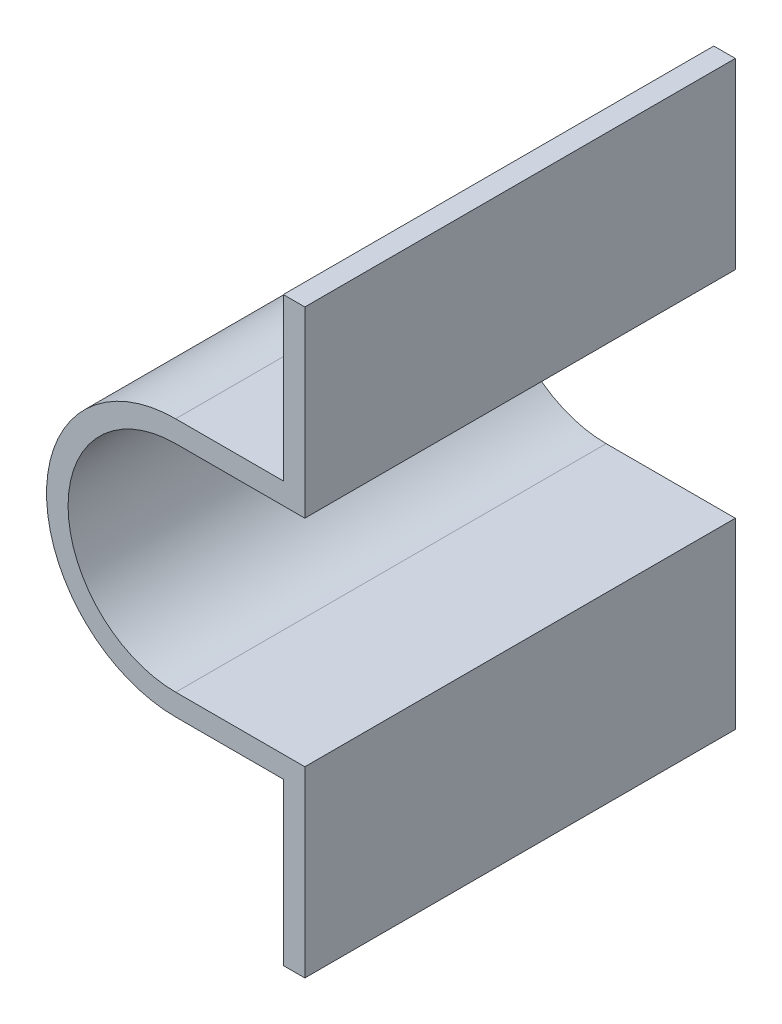
ISO-10303-21;
HEADER;
FILE_DESCRIPTION(('STEP AP214'),'2;1');
FILE_NAME('part.step','',(''),(''),'','','');
FILE_SCHEMA(('AUTOMOTIVE_DESIGN { 1 0 10303 214 1 1 1 1 }'));
ENDSEC;
DATA;
#1=APPLICATION_CONTEXT('core data for automotive mechanical design processes');
#2=APPLICATION_PROTOCOL_DEFINITION('international standard','automotive_design',2000,#1);
#3=PRODUCT_CONTEXT('',#1,'mechanical');
#4=PRODUCT('Part','Part','',(#3));
#5=PRODUCT_RELATED_PRODUCT_CATEGORY('part','',(#4));
#6=PRODUCT_DEFINITION_FORMATION('','',#4);
#7=PRODUCT_DEFINITION_CONTEXT('part definition',#1,'design');
#8=PRODUCT_DEFINITION('design','',#6,#7);
#9=PRODUCT_DEFINITION_SHAPE('','',#8);
#10=(LENGTH_UNIT() NAMED_UNIT(*) SI_UNIT(.MILLI.,.METRE.));
#11=(NAMED_UNIT(*) PLANE_ANGLE_UNIT() SI_UNIT($,.RADIAN.));
#12=(NAMED_UNIT(*) SI_UNIT($,.STERADIAN.) SOLID_ANGLE_UNIT());
#13=UNCERTAINTY_MEASURE_WITH_UNIT(LENGTH_MEASURE(1.E-05),#10,'distance_accuracy_value','');
#14=(GEOMETRIC_REPRESENTATION_CONTEXT(3) GLOBAL_UNCERTAINTY_ASSIGNED_CONTEXT((#13)) GLOBAL_UNIT_ASSIGNED_CONTEXT((#10,
#11,#12)) REPRESENTATION_CONTEXT('',''));
#15=CARTESIAN_POINT('',(0.,0.,0.));
#16=DIRECTION('',(0.,0.,1.));
#17=DIRECTION('',(1.,0.,0.));
#18=AXIS2_PLACEMENT_3D('',#15,#16,#17);
#19=CARTESIAN_POINT('',(0.,0.,40.));
#20=DIRECTION('',(0.,0.,-1.));
#21=DIRECTION('',(-1.,0.,0.));
#22=AXIS2_PLACEMENT_3D('',#19,#20,#21);
#23=CYLINDRICAL_SURFACE('',#22,10.);
#24=CARTESIAN_POINT('',(0.,0.,0.));
#25=DIRECTION('',(0.,0.,-1.));
#26=DIRECTION('',(1.,0.,0.));
#27=AXIS2_PLACEMENT_3D('',#24,#25,#26);
#28=CIRCLE('',#27,10.);
#29=CARTESIAN_POINT('',(0.,-10.,0.));
#30=VERTEX_POINT('',#29);
#31=CARTESIAN_POINT('',(0.,10.,0.));
#32=VERTEX_POINT('',#31);
#33=EDGE_CURVE('E164',#30,#32,#28,.T.);
#34=ORIENTED_EDGE('',*,*,#33,.T.);
#35=DIRECTION('',(0.,0.,-1.));
#36=VECTOR('',#35,1.);
#37=CARTESIAN_POINT('',(0.,10.,40.));
#38=LINE('',#37,#36);
#39=CARTESIAN_POINT('',(0.,10.,40.));
#40=VERTEX_POINT('',#39);
#41=EDGE_CURVE('E11',#40,#32,#38,.T.);
#42=ORIENTED_EDGE('',*,*,#41,.F.);
#43=CARTESIAN_POINT('',(0.,0.,40.));
#44=DIRECTION('',(0.,0.,-1.));
#45=DIRECTION('',(1.,0.,0.));
#46=AXIS2_PLACEMENT_3D('',#43,#44,#45);
#47=CIRCLE('',#46,10.);
#48=CARTESIAN_POINT('',(0.,-10.,40.));
#49=VERTEX_POINT('',#48);
#50=EDGE_CURVE('E198',#49,#40,#47,.T.);
#51=ORIENTED_EDGE('',*,*,#50,.F.);
#52=DIRECTION('',(0.,0.,-1.));
#53=VECTOR('',#52,1.);
#54=CARTESIAN_POINT('',(0.,-10.,40.));
#55=LINE('',#54,#53);
#56=EDGE_CURVE('E160',#49,#30,#55,.T.);
#57=ORIENTED_EDGE('',*,*,#56,.T.);
#58=EDGE_LOOP('',(#34,#42,#51,#57));
#59=FACE_BOUND('',#58,.T.);
#60=ADVANCED_FACE('F39',(#59),#23,.F.);
#61=CARTESIAN_POINT('',(12.,10.,40.));
#62=DIRECTION('',(0.,1.,0.));
#63=DIRECTION('',(0.,0.,1.));
#64=AXIS2_PLACEMENT_3D('',#61,#62,#63);
#65=PLANE('',#64);
#66=DIRECTION('',(1.,0.,0.));
#67=VECTOR('',#66,1.);
#68=CARTESIAN_POINT('',(12.,10.,0.));
#69=LINE('',#68,#67);
#70=CARTESIAN_POINT('',(12.,10.,0.));
#71=VERTEX_POINT('',#70);
#72=EDGE_CURVE('E168',#32,#71,#69,.T.);
#73=ORIENTED_EDGE('',*,*,#72,.T.);
#74=DIRECTION('',(0.,0.,-1.));
#75=VECTOR('',#74,1.);
#76=CARTESIAN_POINT('',(12.,10.,40.));
#77=LINE('',#76,#75);
#78=CARTESIAN_POINT('',(12.,10.,40.));
#79=VERTEX_POINT('',#78);
#80=EDGE_CURVE('E48',#79,#71,#77,.T.);
#81=ORIENTED_EDGE('',*,*,#80,.F.);
#82=DIRECTION('',(1.,0.,0.));
#83=VECTOR('',#82,1.);
#84=CARTESIAN_POINT('',(12.,10.,40.));
#85=LINE('',#84,#83);
#86=EDGE_CURVE('E111',#40,#79,#85,.T.);
#87=ORIENTED_EDGE('',*,*,#86,.F.);
#88=ORIENTED_EDGE('',*,*,#41,.T.);
#89=EDGE_LOOP('',(#73,#81,#87,#88));
#90=FACE_BOUND('',#89,.T.);
#91=ADVANCED_FACE('F292',(#90),#65,.F.);
#92=CARTESIAN_POINT('',(12.,27.,40.));
#93=DIRECTION('',(-1.,0.,0.));
#94=DIRECTION('',(0.,-1.,0.));
#95=AXIS2_PLACEMENT_3D('',#92,#93,#94);
#96=PLANE('',#95);
#97=DIRECTION('',(0.,1.,0.));
#98=VECTOR('',#97,1.);
#99=CARTESIAN_POINT('',(12.,27.,0.));
#100=LINE('',#99,#98);
#101=CARTESIAN_POINT('',(12.,27.,0.));
#102=VERTEX_POINT('',#101);
#103=EDGE_CURVE('E171',#71,#102,#100,.T.);
#104=ORIENTED_EDGE('',*,*,#103,.T.);
#105=DIRECTION('',(0.,0.,-1.));
#106=VECTOR('',#105,1.);
#107=CARTESIAN_POINT('',(12.,27.,40.));
#108=LINE('',#107,#106);
#109=CARTESIAN_POINT('',(12.,27.,40.));
#110=VERTEX_POINT('',#109);
#111=EDGE_CURVE('E225',#110,#102,#108,.T.);
#112=ORIENTED_EDGE('',*,*,#111,.F.);
#113=DIRECTION('',(0.,1.,0.));
#114=VECTOR('',#113,1.);
#115=CARTESIAN_POINT('',(12.,27.,40.));
#116=LINE('',#115,#114);
#117=EDGE_CURVE('E235',#79,#110,#116,.T.);
#118=ORIENTED_EDGE('',*,*,#117,.F.);
#119=ORIENTED_EDGE('',*,*,#80,.T.);
#120=EDGE_LOOP('',(#104,#112,#118,#119));
#121=FACE_BOUND('',#120,.T.);
#122=ADVANCED_FACE('F233',(#121),#96,.F.);
#123=CARTESIAN_POINT('',(10.,27.,40.));
#124=DIRECTION('',(0.,-1.,0.));
#125=DIRECTION('',(0.,0.,-1.));
#126=AXIS2_PLACEMENT_3D('',#123,#124,#125);
#127=PLANE('',#126);
#128=DIRECTION('',(-1.,0.,0.));
#129=VECTOR('',#128,1.);
#130=CARTESIAN_POINT('',(10.,27.,0.));
#131=LINE('',#130,#129);
#132=CARTESIAN_POINT('',(10.,27.,0.));
#133=VERTEX_POINT('',#132);
#134=EDGE_CURVE('E174',#102,#133,#131,.T.);
#135=ORIENTED_EDGE('',*,*,#134,.T.);
#136=DIRECTION('',(0.,0.,-1.));
#137=VECTOR('',#136,1.);
#138=CARTESIAN_POINT('',(10.,27.,40.));
#139=LINE('',#138,#137);
#140=CARTESIAN_POINT('',(10.,27.,40.));
#141=VERTEX_POINT('',#140);
#142=EDGE_CURVE('E221',#141,#133,#139,.T.);
#143=ORIENTED_EDGE('',*,*,#142,.F.);
#144=DIRECTION('',(-1.,0.,0.));
#145=VECTOR('',#144,1.);
#146=CARTESIAN_POINT('',(10.,27.,40.));
#147=LINE('',#146,#145);
#148=EDGE_CURVE('E254',#110,#141,#147,.T.);
#149=ORIENTED_EDGE('',*,*,#148,.F.);
#150=ORIENTED_EDGE('',*,*,#111,.T.);
#151=EDGE_LOOP('',(#135,#143,#149,#150));
#152=FACE_BOUND('',#151,.T.);
#153=ADVANCED_FACE('F244',(#152),#127,.F.);
#154=CARTESIAN_POINT('',(10.,12.,40.));
#155=DIRECTION('',(1.,0.,0.));
#156=DIRECTION('',(0.,0.,-1.));
#157=AXIS2_PLACEMENT_3D('',#154,#155,#156);
#158=PLANE('',#157);
#159=DIRECTION('',(0.,-1.,0.));
#160=VECTOR('',#159,1.);
#161=CARTESIAN_POINT('',(10.,12.,0.));
#162=LINE('',#161,#160);
#163=CARTESIAN_POINT('',(10.,12.,0.));
#164=VERTEX_POINT('',#163);
#165=EDGE_CURVE('E177',#133,#164,#162,.T.);
#166=ORIENTED_EDGE('',*,*,#165,.T.);
#167=DIRECTION('',(0.,0.,-1.));
#168=VECTOR('',#167,1.);
#169=CARTESIAN_POINT('',(10.,12.,40.));
#170=LINE('',#169,#168);
#171=CARTESIAN_POINT('',(10.,12.,40.));
#172=VERTEX_POINT('',#171);
#173=EDGE_CURVE('E217',#172,#164,#170,.T.);
#174=ORIENTED_EDGE('',*,*,#173,.F.);
#175=DIRECTION('',(0.,-1.,0.));
#176=VECTOR('',#175,1.);
#177=CARTESIAN_POINT('',(10.,12.,40.));
#178=LINE('',#177,#176);
#179=EDGE_CURVE('E250',#141,#172,#178,.T.);
#180=ORIENTED_EDGE('',*,*,#179,.F.);
#181=ORIENTED_EDGE('',*,*,#142,.T.);
#182=EDGE_LOOP('',(#166,#174,#180,#181));
#183=FACE_BOUND('',#182,.T.);
#184=ADVANCED_FACE('F248',(#183),#158,.F.);
#185=CARTESIAN_POINT('',(0.,12.,40.));
#186=DIRECTION('',(0.,-1.,0.));
#187=DIRECTION('',(0.,0.,-1.));
#188=AXIS2_PLACEMENT_3D('',#185,#186,#187);
#189=PLANE('',#188);
#190=DIRECTION('',(-1.,0.,0.));
#191=VECTOR('',#190,1.);
#192=CARTESIAN_POINT('',(0.,12.,0.));
#193=LINE('',#192,#191);
#194=CARTESIAN_POINT('',(0.,12.,0.));
#195=VERTEX_POINT('',#194);
#196=EDGE_CURVE('E180',#164,#195,#193,.T.);
#197=ORIENTED_EDGE('',*,*,#196,.T.);
#198=DIRECTION('',(0.,0.,-1.));
#199=VECTOR('',#198,1.);
#200=CARTESIAN_POINT('',(0.,12.,40.));
#201=LINE('',#200,#199);
#202=CARTESIAN_POINT('',(0.,12.,40.));
#203=VERTEX_POINT('',#202);
#204=EDGE_CURVE('E213',#203,#195,#201,.T.);
#205=ORIENTED_EDGE('',*,*,#204,.F.);
#206=DIRECTION('',(-1.,0.,0.));
#207=VECTOR('',#206,1.);
#208=CARTESIAN_POINT('',(0.,12.,40.));
#209=LINE('',#208,#207);
#210=EDGE_CURVE('E253',#172,#203,#209,.T.);
#211=ORIENTED_EDGE('',*,*,#210,.F.);
#212=ORIENTED_EDGE('',*,*,#173,.T.);
#213=EDGE_LOOP('',(#197,#205,#211,#212));
#214=FACE_BOUND('',#213,.T.);
#215=ADVANCED_FACE('F305',(#214),#189,.F.);
#216=CARTESIAN_POINT('',(0.,0.,40.));
#217=DIRECTION('',(0.,0.,-1.));
#218=DIRECTION('',(-1.,0.,0.));
#219=AXIS2_PLACEMENT_3D('',#216,#217,#218);
#220=CYLINDRICAL_SURFACE('',#219,12.);
#221=CARTESIAN_POINT('',(0.,0.,0.));
#222=DIRECTION('',(0.,0.,1.));
#223=DIRECTION('',(1.,0.,0.));
#224=AXIS2_PLACEMENT_3D('',#221,#222,#223);
#225=CIRCLE('',#224,12.);
#226=CARTESIAN_POINT('',(0.,-12.,0.));
#227=VERTEX_POINT('',#226);
#228=EDGE_CURVE('E183',#195,#227,#225,.T.);
#229=ORIENTED_EDGE('',*,*,#228,.T.);
#230=DIRECTION('',(0.,0.,-1.));
#231=VECTOR('',#230,1.);
#232=CARTESIAN_POINT('',(0.,-12.,40.));
#233=LINE('',#232,#231);
#234=CARTESIAN_POINT('',(0.,-12.,40.));
#235=VERTEX_POINT('',#234);
#236=EDGE_CURVE('E209',#235,#227,#233,.T.);
#237=ORIENTED_EDGE('',*,*,#236,.F.);
#238=CARTESIAN_POINT('',(0.,0.,40.));
#239=DIRECTION('',(0.,0.,1.));
#240=DIRECTION('',(1.,0.,0.));
#241=AXIS2_PLACEMENT_3D('',#238,#239,#240);
#242=CIRCLE('',#241,12.);
#243=EDGE_CURVE('E258',#203,#235,#242,.T.);
#244=ORIENTED_EDGE('',*,*,#243,.F.);
#245=ORIENTED_EDGE('',*,*,#204,.T.);
#246=EDGE_LOOP('',(#229,#237,#244,#245));
#247=FACE_BOUND('',#246,.T.);
#248=ADVANCED_FACE('F308',(#247),#220,.T.);
#249=CARTESIAN_POINT('',(10.,-12.,40.));
#250=DIRECTION('',(0.,1.,0.));
#251=DIRECTION('',(0.,0.,1.));
#252=AXIS2_PLACEMENT_3D('',#249,#250,#251);
#253=PLANE('',#252);
#254=DIRECTION('',(1.,0.,0.));
#255=VECTOR('',#254,1.);
#256=CARTESIAN_POINT('',(10.,-12.,0.));
#257=LINE('',#256,#255);
#258=CARTESIAN_POINT('',(10.,-12.,0.));
#259=VERTEX_POINT('',#258);
#260=EDGE_CURVE('E186',#227,#259,#257,.T.);
#261=ORIENTED_EDGE('',*,*,#260,.T.);
#262=DIRECTION('',(0.,0.,-1.));
#263=VECTOR('',#262,1.);
#264=CARTESIAN_POINT('',(10.,-12.,40.));
#265=LINE('',#264,#263);
#266=CARTESIAN_POINT('',(10.,-12.,40.));
#267=VERTEX_POINT('',#266);
#268=EDGE_CURVE('E205',#267,#259,#265,.T.);
#269=ORIENTED_EDGE('',*,*,#268,.F.);
#270=DIRECTION('',(1.,0.,0.));
#271=VECTOR('',#270,1.);
#272=CARTESIAN_POINT('',(10.,-12.,40.));
#273=LINE('',#272,#271);
#274=EDGE_CURVE('E265',#235,#267,#273,.T.);
#275=ORIENTED_EDGE('',*,*,#274,.F.);
#276=ORIENTED_EDGE('',*,*,#236,.T.);
#277=EDGE_LOOP('',(#261,#269,#275,#276));
#278=FACE_BOUND('',#277,.T.);
#279=ADVANCED_FACE('F273',(#278),#253,.F.);
#280=CARTESIAN_POINT('',(10.,-27.,40.));
#281=DIRECTION('',(1.,0.,0.));
#282=DIRECTION('',(0.,1.,0.));
#283=AXIS2_PLACEMENT_3D('',#280,#281,#282);
#284=PLANE('',#283);
#285=DIRECTION('',(0.,-1.,0.));
#286=VECTOR('',#285,1.);
#287=CARTESIAN_POINT('',(10.,-27.,0.));
#288=LINE('',#287,#286);
#289=CARTESIAN_POINT('',(10.,-27.,0.));
#290=VERTEX_POINT('',#289);
#291=EDGE_CURVE('E189',#259,#290,#288,.T.);
#292=ORIENTED_EDGE('',*,*,#291,.T.);
#293=DIRECTION('',(0.,0.,-1.));
#294=VECTOR('',#293,1.);
#295=CARTESIAN_POINT('',(10.,-27.,40.));
#296=LINE('',#295,#294);
#297=CARTESIAN_POINT('',(10.,-27.,40.));
#298=VERTEX_POINT('',#297);
#299=EDGE_CURVE('E153',#298,#290,#296,.T.);
#300=ORIENTED_EDGE('',*,*,#299,.F.);
#301=DIRECTION('',(0.,-1.,0.));
#302=VECTOR('',#301,1.);
#303=CARTESIAN_POINT('',(10.,-27.,40.));
#304=LINE('',#303,#302);
#305=EDGE_CURVE('E142',#267,#298,#304,.T.);
#306=ORIENTED_EDGE('',*,*,#305,.F.);
#307=ORIENTED_EDGE('',*,*,#268,.T.);
#308=EDGE_LOOP('',(#292,#300,#306,#307));
#309=FACE_BOUND('',#308,.T.);
#310=ADVANCED_FACE('F277',(#309),#284,.F.);
#311=CARTESIAN_POINT('',(12.,-27.,40.));
#312=DIRECTION('',(0.,1.,0.));
#313=DIRECTION('',(-1.,0.,0.));
#314=AXIS2_PLACEMENT_3D('',#311,#312,#313);
#315=PLANE('',#314);
#316=DIRECTION('',(1.,0.,0.));
#317=VECTOR('',#316,1.);
#318=CARTESIAN_POINT('',(12.,-27.,0.));
#319=LINE('',#318,#317);
#320=CARTESIAN_POINT('',(12.,-27.,0.));
#321=VERTEX_POINT('',#320);
#322=EDGE_CURVE('E151',#290,#321,#319,.T.);
#323=ORIENTED_EDGE('',*,*,#322,.T.);
#324=DIRECTION('',(0.,0.,-1.));
#325=VECTOR('',#324,1.);
#326=CARTESIAN_POINT('',(12.,-27.,40.));
#327=LINE('',#326,#325);
#328=CARTESIAN_POINT('',(12.,-27.,40.));
#329=VERTEX_POINT('',#328);
#330=EDGE_CURVE('E148',#329,#321,#327,.T.);
#331=ORIENTED_EDGE('',*,*,#330,.F.);
#332=DIRECTION('',(1.,0.,0.));
#333=VECTOR('',#332,1.);
#334=CARTESIAN_POINT('',(12.,-27.,40.));
#335=LINE('',#334,#333);
#336=EDGE_CURVE('E136',#298,#329,#335,.T.);
#337=ORIENTED_EDGE('',*,*,#336,.F.);
#338=ORIENTED_EDGE('',*,*,#299,.T.);
#339=EDGE_LOOP('',(#323,#331,#337,#338));
#340=FACE_BOUND('',#339,.T.);
#341=ADVANCED_FACE('F149',(#340),#315,.F.);
#342=CARTESIAN_POINT('',(12.,-10.,40.));
#343=DIRECTION('',(-1.,0.,0.));
#344=DIRECTION('',(0.,-1.,0.));
#345=AXIS2_PLACEMENT_3D('',#342,#343,#344);
#346=PLANE('',#345);
#347=DIRECTION('',(0.,1.,0.));
#348=VECTOR('',#347,1.);
#349=CARTESIAN_POINT('',(12.,-10.,0.));
#350=LINE('',#349,#348);
#351=CARTESIAN_POINT('',(12.,-10.,0.));
#352=VERTEX_POINT('',#351);
#353=EDGE_CURVE('E97',#321,#352,#350,.T.);
#354=ORIENTED_EDGE('',*,*,#353,.T.);
#355=DIRECTION('',(0.,0.,-1.));
#356=VECTOR('',#355,1.);
#357=CARTESIAN_POINT('',(12.,-10.,40.));
#358=LINE('',#357,#356);
#359=CARTESIAN_POINT('',(12.,-10.,40.));
#360=VERTEX_POINT('',#359);
#361=EDGE_CURVE('E154',#360,#352,#358,.T.);
#362=ORIENTED_EDGE('',*,*,#361,.F.);
#363=DIRECTION('',(0.,1.,0.));
#364=VECTOR('',#363,1.);
#365=CARTESIAN_POINT('',(12.,-10.,40.));
#366=LINE('',#365,#364);
#367=EDGE_CURVE('E140',#329,#360,#366,.T.);
#368=ORIENTED_EDGE('',*,*,#367,.F.);
#369=ORIENTED_EDGE('',*,*,#330,.T.);
#370=EDGE_LOOP('',(#354,#362,#368,#369));
#371=FACE_BOUND('',#370,.T.);
#372=ADVANCED_FACE('F156',(#371),#346,.F.);
#373=CARTESIAN_POINT('',(0.,-10.,40.));
#374=DIRECTION('',(0.,-1.,0.));
#375=DIRECTION('',(0.,0.,-1.));
#376=AXIS2_PLACEMENT_3D('',#373,#374,#375);
#377=PLANE('',#376);
#378=DIRECTION('',(-1.,0.,0.));
#379=VECTOR('',#378,1.);
#380=CARTESIAN_POINT('',(0.,-10.,0.));
#381=LINE('',#380,#379);
#382=EDGE_CURVE('E103',#352,#30,#381,.T.);
#383=ORIENTED_EDGE('',*,*,#382,.T.);
#384=ORIENTED_EDGE('',*,*,#56,.F.);
#385=DIRECTION('',(-1.,0.,0.));
#386=VECTOR('',#385,1.);
#387=CARTESIAN_POINT('',(0.,-10.,40.));
#388=LINE('',#387,#386);
#389=EDGE_CURVE('E56',#360,#49,#388,.T.);
#390=ORIENTED_EDGE('',*,*,#389,.F.);
#391=ORIENTED_EDGE('',*,*,#361,.T.);
#392=EDGE_LOOP('',(#383,#384,#390,#391));
#393=FACE_BOUND('',#392,.T.);
#394=ADVANCED_FACE('F281',(#393),#377,.F.);
#395=CARTESIAN_POINT('',(0.,0.,40.));
#396=DIRECTION('',(0.,0.,1.));
#397=DIRECTION('',(1.,0.,0.));
#398=AXIS2_PLACEMENT_3D('',#395,#396,#397);
#399=PLANE('',#398);
#400=ORIENTED_EDGE('',*,*,#50,.T.);
#401=ORIENTED_EDGE('',*,*,#86,.T.);
#402=ORIENTED_EDGE('',*,*,#117,.T.);
#403=ORIENTED_EDGE('',*,*,#148,.T.);
#404=ORIENTED_EDGE('',*,*,#179,.T.);
#405=ORIENTED_EDGE('',*,*,#210,.T.);
#406=ORIENTED_EDGE('',*,*,#243,.T.);
#407=ORIENTED_EDGE('',*,*,#274,.T.);
#408=ORIENTED_EDGE('',*,*,#305,.T.);
#409=ORIENTED_EDGE('',*,*,#336,.T.);
#410=ORIENTED_EDGE('',*,*,#367,.T.);
#411=ORIENTED_EDGE('',*,*,#389,.T.);
#412=EDGE_LOOP('',(#400,#401,#402,#403,#404,#405,#406,#407,#408,#409,#410,#411));
#413=FACE_BOUND('',#412,.T.);
#414=ADVANCED_FACE('F138',(#413),#399,.T.);
#415=CARTESIAN_POINT('',(0.,0.,0.));
#416=DIRECTION('',(0.,0.,1.));
#417=DIRECTION('',(1.,0.,0.));
#418=AXIS2_PLACEMENT_3D('',#415,#416,#417);
#419=PLANE('',#418);
#420=ORIENTED_EDGE('',*,*,#33,.F.);
#421=ORIENTED_EDGE('',*,*,#382,.F.);
#422=ORIENTED_EDGE('',*,*,#353,.F.);
#423=ORIENTED_EDGE('',*,*,#322,.F.);
#424=ORIENTED_EDGE('',*,*,#291,.F.);
#425=ORIENTED_EDGE('',*,*,#260,.F.);
#426=ORIENTED_EDGE('',*,*,#228,.F.);
#427=ORIENTED_EDGE('',*,*,#196,.F.);
#428=ORIENTED_EDGE('',*,*,#165,.F.);
#429=ORIENTED_EDGE('',*,*,#134,.F.);
#430=ORIENTED_EDGE('',*,*,#103,.F.);
#431=ORIENTED_EDGE('',*,*,#72,.F.);
#432=EDGE_LOOP('',(#420,#421,#422,#423,#424,#425,#426,#427,#428,#429,#430,#431));
#433=FACE_BOUND('',#432,.T.);
#434=ADVANCED_FACE('F239',(#433),#419,.F.);
#435=CLOSED_SHELL('',(#60,#91,#122,#153,#184,#215,#248,#279,#310,#341,#372,#394,#414,#434));
#436=MANIFOLD_SOLID_BREP('B2',#435);
#437=ADVANCED_BREP_SHAPE_REPRESENTATION('',(#18,#436),#14);
#438=SHAPE_DEFINITION_REPRESENTATION(#9,#437);
ENDSEC;
END-ISO-10303-21;
